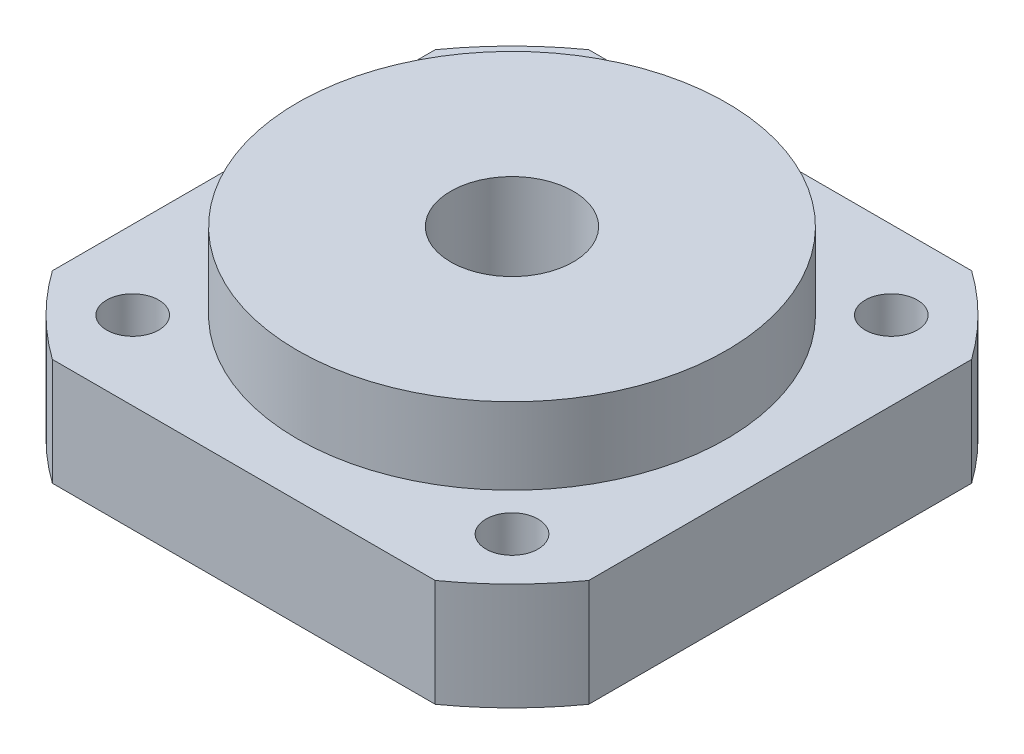
ISO-10303-21;
HEADER;
FILE_DESCRIPTION(('STEP AP214'),'2;1');
FILE_NAME('part.step','',(''),(''),'','','');
FILE_SCHEMA(('AUTOMOTIVE_DESIGN { 1 0 10303 214 1 1 1 1 }'));
ENDSEC;
DATA;
#1=APPLICATION_CONTEXT('core data for automotive mechanical design processes');
#2=APPLICATION_PROTOCOL_DEFINITION('international standard','automotive_design',2000,#1);
#3=PRODUCT_CONTEXT('',#1,'mechanical');
#4=PRODUCT('Part','Part','',(#3));
#5=PRODUCT_RELATED_PRODUCT_CATEGORY('part','',(#4));
#6=PRODUCT_DEFINITION_FORMATION('','',#4);
#7=PRODUCT_DEFINITION_CONTEXT('part definition',#1,'design');
#8=PRODUCT_DEFINITION('design','',#6,#7);
#9=PRODUCT_DEFINITION_SHAPE('','',#8);
#10=(LENGTH_UNIT() NAMED_UNIT(*) SI_UNIT(.MILLI.,.METRE.));
#11=(NAMED_UNIT(*) PLANE_ANGLE_UNIT() SI_UNIT($,.RADIAN.));
#12=(NAMED_UNIT(*) SI_UNIT($,.STERADIAN.) SOLID_ANGLE_UNIT());
#13=UNCERTAINTY_MEASURE_WITH_UNIT(LENGTH_MEASURE(1.E-05),#10,'distance_accuracy_value','');
#14=(GEOMETRIC_REPRESENTATION_CONTEXT(3) GLOBAL_UNCERTAINTY_ASSIGNED_CONTEXT((#13)) GLOBAL_UNIT_ASSIGNED_CONTEXT((#10,
#11,#12)) REPRESENTATION_CONTEXT('',''));
#15=CARTESIAN_POINT('',(0.,0.,0.));
#16=DIRECTION('',(0.,0.,1.));
#17=DIRECTION('',(1.,0.,0.));
#18=AXIS2_PLACEMENT_3D('',#15,#16,#17);
#19=CARTESIAN_POINT('',(-12.3743686707646,12.,-12.3743686707646));
#20=DIRECTION('',(0.,-1.,0.));
#21=DIRECTION('',(0.,0.,-1.));
#22=AXIS2_PLACEMENT_3D('',#19,#20,#21);
#23=CYLINDRICAL_SURFACE('',#22,1.7);
#24=CARTESIAN_POINT('',(-12.3743686707646,7.,-12.3743686707646));
#25=DIRECTION('',(0.,1.,0.));
#26=DIRECTION('',(0.,0.,1.));
#27=AXIS2_PLACEMENT_3D('',#24,#25,#26);
#28=CIRCLE('',#27,1.7);
#29=CARTESIAN_POINT('',(-12.3743686707646,7.,-10.6743686707646));
#30=VERTEX_POINT('',#29);
#31=EDGE_CURVE('E209',#30,#30,#28,.T.);
#32=ORIENTED_EDGE('',*,*,#31,.T.);
#33=EDGE_LOOP('',(#32));
#34=FACE_BOUND('',#33,.T.);
#35=CARTESIAN_POINT('',(-12.3743686707646,4.,-12.3743686707646));
#36=DIRECTION('',(0.,-1.,0.));
#37=DIRECTION('',(0.,0.,-1.));
#38=AXIS2_PLACEMENT_3D('',#35,#36,#37);
#39=CIRCLE('',#38,1.7);
#40=CARTESIAN_POINT('',(-12.3743686707646,4.,-14.0743686707646));
#41=VERTEX_POINT('',#40);
#42=EDGE_CURVE('E38',#41,#41,#39,.T.);
#43=ORIENTED_EDGE('',*,*,#42,.T.);
#44=EDGE_LOOP('',(#43));
#45=FACE_BOUND('',#44,.T.);
#46=ADVANCED_FACE('F34',(#34,#45),#23,.F.);
#47=CARTESIAN_POINT('',(12.3743686707646,12.,-12.3743686707646));
#48=DIRECTION('',(0.,-1.,0.));
#49=DIRECTION('',(0.,0.,-1.));
#50=AXIS2_PLACEMENT_3D('',#47,#48,#49);
#51=CYLINDRICAL_SURFACE('',#50,1.7);
#52=CARTESIAN_POINT('',(12.3743686707646,7.,-12.3743686707646));
#53=DIRECTION('',(0.,1.,0.));
#54=DIRECTION('',(0.,0.,1.));
#55=AXIS2_PLACEMENT_3D('',#52,#53,#54);
#56=CIRCLE('',#55,1.7);
#57=CARTESIAN_POINT('',(12.3743686707646,7.,-10.6743686707646));
#58=VERTEX_POINT('',#57);
#59=EDGE_CURVE('E206',#58,#58,#56,.T.);
#60=ORIENTED_EDGE('',*,*,#59,.T.);
#61=EDGE_LOOP('',(#60));
#62=FACE_BOUND('',#61,.T.);
#63=CARTESIAN_POINT('',(12.3743686707646,4.,-12.3743686707646));
#64=DIRECTION('',(0.,-1.,0.));
#65=DIRECTION('',(0.,0.,-1.));
#66=AXIS2_PLACEMENT_3D('',#63,#64,#65);
#67=CIRCLE('',#66,1.7);
#68=CARTESIAN_POINT('',(12.3743686707646,4.,-14.0743686707646));
#69=VERTEX_POINT('',#68);
#70=EDGE_CURVE('E171',#69,#69,#67,.T.);
#71=ORIENTED_EDGE('',*,*,#70,.T.);
#72=EDGE_LOOP('',(#71));
#73=FACE_BOUND('',#72,.T.);
#74=ADVANCED_FACE('F253',(#62,#73),#51,.F.);
#75=CARTESIAN_POINT('',(12.3743686707646,12.,12.3743686707646));
#76=DIRECTION('',(0.,-1.,0.));
#77=DIRECTION('',(0.,0.,-1.));
#78=AXIS2_PLACEMENT_3D('',#75,#76,#77);
#79=CYLINDRICAL_SURFACE('',#78,1.7);
#80=CARTESIAN_POINT('',(12.3743686707646,7.,12.3743686707646));
#81=DIRECTION('',(0.,1.,0.));
#82=DIRECTION('',(0.,0.,1.));
#83=AXIS2_PLACEMENT_3D('',#80,#81,#82);
#84=CIRCLE('',#83,1.7);
#85=CARTESIAN_POINT('',(12.3743686707646,7.,14.0743686707646));
#86=VERTEX_POINT('',#85);
#87=EDGE_CURVE('E161',#86,#86,#84,.T.);
#88=ORIENTED_EDGE('',*,*,#87,.T.);
#89=EDGE_LOOP('',(#88));
#90=FACE_BOUND('',#89,.T.);
#91=CARTESIAN_POINT('',(12.3743686707646,4.,12.3743686707646));
#92=DIRECTION('',(0.,-1.,0.));
#93=DIRECTION('',(0.,0.,-1.));
#94=AXIS2_PLACEMENT_3D('',#91,#92,#93);
#95=CIRCLE('',#94,1.7);
#96=CARTESIAN_POINT('',(12.3743686707646,4.,10.6743686707646));
#97=VERTEX_POINT('',#96);
#98=EDGE_CURVE('E167',#97,#97,#95,.T.);
#99=ORIENTED_EDGE('',*,*,#98,.T.);
#100=EDGE_LOOP('',(#99));
#101=FACE_BOUND('',#100,.T.);
#102=ADVANCED_FACE('F259',(#90,#101),#79,.F.);
#103=CARTESIAN_POINT('',(-12.3743686707646,12.,12.3743686707646));
#104=DIRECTION('',(0.,-1.,0.));
#105=DIRECTION('',(0.,0.,-1.));
#106=AXIS2_PLACEMENT_3D('',#103,#104,#105);
#107=CYLINDRICAL_SURFACE('',#106,1.7);
#108=CARTESIAN_POINT('',(-12.3743686707646,7.,12.3743686707646));
#109=DIRECTION('',(0.,1.,0.));
#110=DIRECTION('',(0.,0.,1.));
#111=AXIS2_PLACEMENT_3D('',#108,#109,#110);
#112=CIRCLE('',#111,1.7);
#113=CARTESIAN_POINT('',(-12.3743686707646,7.,14.0743686707646));
#114=VERTEX_POINT('',#113);
#115=EDGE_CURVE('E158',#114,#114,#112,.T.);
#116=ORIENTED_EDGE('',*,*,#115,.T.);
#117=EDGE_LOOP('',(#116));
#118=FACE_BOUND('',#117,.T.);
#119=CARTESIAN_POINT('',(-12.3743686707646,4.,12.3743686707646));
#120=DIRECTION('',(0.,-1.,0.));
#121=DIRECTION('',(0.,0.,-1.));
#122=AXIS2_PLACEMENT_3D('',#119,#120,#121);
#123=CIRCLE('',#122,1.7);
#124=CARTESIAN_POINT('',(-12.3743686707646,4.,10.6743686707646));
#125=VERTEX_POINT('',#124);
#126=EDGE_CURVE('E162',#125,#125,#123,.T.);
#127=ORIENTED_EDGE('',*,*,#126,.T.);
#128=EDGE_LOOP('',(#127));
#129=FACE_BOUND('',#128,.T.);
#130=ADVANCED_FACE('F270',(#118,#129),#107,.F.);
#131=CARTESIAN_POINT('',(0.,12.,0.));
#132=DIRECTION('',(0.,1.,0.));
#133=DIRECTION('',(0.,0.,1.));
#134=AXIS2_PLACEMENT_3D('',#131,#132,#133);
#135=PLANE('',#134);
#136=CARTESIAN_POINT('',(0.,12.,0.));
#137=DIRECTION('',(0.,1.,0.));
#138=DIRECTION('',(0.,0.,1.));
#139=AXIS2_PLACEMENT_3D('',#136,#137,#138);
#140=CIRCLE('',#139,4.);
#141=CARTESIAN_POINT('',(0.,12.,4.));
#142=VERTEX_POINT('',#141);
#143=EDGE_CURVE('E122',#142,#142,#140,.T.);
#144=ORIENTED_EDGE('',*,*,#143,.F.);
#145=EDGE_LOOP('',(#144));
#146=FACE_BOUND('',#145,.T.);
#147=CARTESIAN_POINT('',(0.,12.,0.));
#148=DIRECTION('',(0.,1.,0.));
#149=DIRECTION('',(0.,0.,1.));
#150=AXIS2_PLACEMENT_3D('',#147,#148,#149);
#151=CIRCLE('',#150,14.);
#152=CARTESIAN_POINT('',(0.,12.,14.));
#153=VERTEX_POINT('',#152);
#154=EDGE_CURVE('E165',#153,#153,#151,.T.);
#155=ORIENTED_EDGE('',*,*,#154,.T.);
#156=EDGE_LOOP('',(#155));
#157=FACE_BOUND('',#156,.T.);
#158=ADVANCED_FACE('F268',(#146,#157),#135,.T.);
#159=CARTESIAN_POINT('',(0.,12.,0.));
#160=DIRECTION('',(0.,-1.,0.));
#161=DIRECTION('',(0.,0.,-1.));
#162=AXIS2_PLACEMENT_3D('',#159,#160,#161);
#163=CYLINDRICAL_SURFACE('',#162,21.5);
#164=CARTESIAN_POINT('',(0.,7.,0.));
#165=DIRECTION('',(0.,1.,0.));
#166=DIRECTION('',(0.,0.,1.));
#167=AXIS2_PLACEMENT_3D('',#164,#165,#166);
#168=CIRCLE('',#167,21.5);
#169=CARTESIAN_POINT('',(12.4899959967968,7.,17.5));
#170=VERTEX_POINT('',#169);
#171=CARTESIAN_POINT('',(17.5,7.,12.4899959967968));
#172=VERTEX_POINT('',#171);
#173=EDGE_CURVE('E99',#170,#172,#168,.T.);
#174=ORIENTED_EDGE('',*,*,#173,.F.);
#175=DIRECTION('',(0.,-1.,0.));
#176=VECTOR('',#175,1.);
#177=CARTESIAN_POINT('',(12.4899959967968,12.,17.5));
#178=LINE('',#177,#176);
#179=CARTESIAN_POINT('',(12.4899959967968,0.,17.5));
#180=VERTEX_POINT('',#179);
#181=EDGE_CURVE('E59',#170,#180,#178,.T.);
#182=ORIENTED_EDGE('',*,*,#181,.T.);
#183=CARTESIAN_POINT('',(0.,0.,0.));
#184=DIRECTION('',(0.,1.,0.));
#185=DIRECTION('',(0.,0.,1.));
#186=AXIS2_PLACEMENT_3D('',#183,#184,#185);
#187=CIRCLE('',#186,21.5);
#188=CARTESIAN_POINT('',(17.5,0.,12.4899959967968));
#189=VERTEX_POINT('',#188);
#190=EDGE_CURVE('E118',#180,#189,#187,.T.);
#191=ORIENTED_EDGE('',*,*,#190,.T.);
#192=DIRECTION('',(0.,-1.,0.));
#193=VECTOR('',#192,1.);
#194=CARTESIAN_POINT('',(17.5,12.,12.4899959967968));
#195=LINE('',#194,#193);
#196=EDGE_CURVE('E11',#172,#189,#195,.T.);
#197=ORIENTED_EDGE('',*,*,#196,.F.);
#198=EDGE_LOOP('',(#174,#182,#191,#197));
#199=FACE_BOUND('',#198,.T.);
#200=ADVANCED_FACE('F36',(#199),#163,.T.);
#201=CARTESIAN_POINT('',(17.5,12.,12.4899959967968));
#202=DIRECTION('',(-1.,0.,0.));
#203=DIRECTION('',(0.,0.,1.));
#204=AXIS2_PLACEMENT_3D('',#201,#202,#203);
#205=PLANE('',#204);
#206=DIRECTION('',(0.,0.,-1.));
#207=VECTOR('',#206,1.);
#208=CARTESIAN_POINT('',(17.5,7.,-17.5));
#209=LINE('',#208,#207);
#210=CARTESIAN_POINT('',(17.5,7.,-12.4899959967968));
#211=VERTEX_POINT('',#210);
#212=EDGE_CURVE('E102',#172,#211,#209,.T.);
#213=ORIENTED_EDGE('',*,*,#212,.F.);
#214=ORIENTED_EDGE('',*,*,#196,.T.);
#215=DIRECTION('',(0.,0.,-1.));
#216=VECTOR('',#215,1.);
#217=CARTESIAN_POINT('',(17.5,0.,12.4899959967968));
#218=LINE('',#217,#216);
#219=CARTESIAN_POINT('',(17.5,0.,-12.4899959967968));
#220=VERTEX_POINT('',#219);
#221=EDGE_CURVE('E121',#189,#220,#218,.T.);
#222=ORIENTED_EDGE('',*,*,#221,.T.);
#223=DIRECTION('',(0.,-1.,0.));
#224=VECTOR('',#223,1.);
#225=CARTESIAN_POINT('',(17.5,12.,-12.4899959967968));
#226=LINE('',#225,#224);
#227=EDGE_CURVE('E43',#211,#220,#226,.T.);
#228=ORIENTED_EDGE('',*,*,#227,.F.);
#229=EDGE_LOOP('',(#213,#214,#222,#228));
#230=FACE_BOUND('',#229,.T.);
#231=ADVANCED_FACE('F111',(#230),#205,.F.);
#232=CARTESIAN_POINT('',(0.,12.,0.));
#233=DIRECTION('',(0.,-1.,0.));
#234=DIRECTION('',(0.,0.,-1.));
#235=AXIS2_PLACEMENT_3D('',#232,#233,#234);
#236=CYLINDRICAL_SURFACE('',#235,21.5);
#237=CARTESIAN_POINT('',(0.,7.,0.));
#238=DIRECTION('',(0.,1.,0.));
#239=DIRECTION('',(0.,0.,1.));
#240=AXIS2_PLACEMENT_3D('',#237,#238,#239);
#241=CIRCLE('',#240,21.5);
#242=CARTESIAN_POINT('',(12.4899959967968,7.,-17.5));
#243=VERTEX_POINT('',#242);
#244=EDGE_CURVE('E107',#211,#243,#241,.T.);
#245=ORIENTED_EDGE('',*,*,#244,.F.);
#246=ORIENTED_EDGE('',*,*,#227,.T.);
#247=CARTESIAN_POINT('',(0.,0.,0.));
#248=DIRECTION('',(0.,1.,0.));
#249=DIRECTION('',(0.,0.,1.));
#250=AXIS2_PLACEMENT_3D('',#247,#248,#249);
#251=CIRCLE('',#250,21.5);
#252=CARTESIAN_POINT('',(12.4899959967968,0.,-17.5));
#253=VERTEX_POINT('',#252);
#254=EDGE_CURVE('E124',#220,#253,#251,.T.);
#255=ORIENTED_EDGE('',*,*,#254,.T.);
#256=DIRECTION('',(0.,-1.,0.));
#257=VECTOR('',#256,1.);
#258=CARTESIAN_POINT('',(12.4899959967968,12.,-17.5));
#259=LINE('',#258,#257);
#260=EDGE_CURVE('E155',#243,#253,#259,.T.);
#261=ORIENTED_EDGE('',*,*,#260,.F.);
#262=EDGE_LOOP('',(#245,#246,#255,#261));
#263=FACE_BOUND('',#262,.T.);
#264=ADVANCED_FACE('F222',(#263),#236,.T.);
#265=CARTESIAN_POINT('',(-12.4899959967968,12.,-17.5));
#266=DIRECTION('',(0.,0.,1.));
#267=DIRECTION('',(1.,0.,0.));
#268=AXIS2_PLACEMENT_3D('',#265,#266,#267);
#269=PLANE('',#268);
#270=DIRECTION('',(-1.,0.,0.));
#271=VECTOR('',#270,1.);
#272=CARTESIAN_POINT('',(-17.5,7.,-17.5));
#273=LINE('',#272,#271);
#274=CARTESIAN_POINT('',(-12.4899959967968,7.,-17.5));
#275=VERTEX_POINT('',#274);
#276=EDGE_CURVE('E114',#243,#275,#273,.T.);
#277=ORIENTED_EDGE('',*,*,#276,.F.);
#278=ORIENTED_EDGE('',*,*,#260,.T.);
#279=DIRECTION('',(-1.,0.,0.));
#280=VECTOR('',#279,1.);
#281=CARTESIAN_POINT('',(-12.4899959967968,0.,-17.5));
#282=LINE('',#281,#280);
#283=CARTESIAN_POINT('',(-12.4899959967968,0.,-17.5));
#284=VERTEX_POINT('',#283);
#285=EDGE_CURVE('E132',#253,#284,#282,.T.);
#286=ORIENTED_EDGE('',*,*,#285,.T.);
#287=DIRECTION('',(0.,-1.,0.));
#288=VECTOR('',#287,1.);
#289=CARTESIAN_POINT('',(-12.4899959967968,12.,-17.5));
#290=LINE('',#289,#288);
#291=EDGE_CURVE('E153',#275,#284,#290,.T.);
#292=ORIENTED_EDGE('',*,*,#291,.F.);
#293=EDGE_LOOP('',(#277,#278,#286,#292));
#294=FACE_BOUND('',#293,.T.);
#295=ADVANCED_FACE('F221',(#294),#269,.F.);
#296=CARTESIAN_POINT('',(0.,12.,0.));
#297=DIRECTION('',(0.,-1.,0.));
#298=DIRECTION('',(0.,0.,-1.));
#299=AXIS2_PLACEMENT_3D('',#296,#297,#298);
#300=CYLINDRICAL_SURFACE('',#299,21.5);
#301=CARTESIAN_POINT('',(0.,7.,0.));
#302=DIRECTION('',(0.,1.,0.));
#303=DIRECTION('',(0.,0.,1.));
#304=AXIS2_PLACEMENT_3D('',#301,#302,#303);
#305=CIRCLE('',#304,21.5);
#306=CARTESIAN_POINT('',(-17.5,7.,-12.4899959967968));
#307=VERTEX_POINT('',#306);
#308=EDGE_CURVE('E213',#275,#307,#305,.T.);
#309=ORIENTED_EDGE('',*,*,#308,.F.);
#310=ORIENTED_EDGE('',*,*,#291,.T.);
#311=CARTESIAN_POINT('',(0.,0.,0.));
#312=DIRECTION('',(0.,1.,0.));
#313=DIRECTION('',(0.,0.,1.));
#314=AXIS2_PLACEMENT_3D('',#311,#312,#313);
#315=CIRCLE('',#314,21.5);
#316=CARTESIAN_POINT('',(-17.5,0.,-12.4899959967968));
#317=VERTEX_POINT('',#316);
#318=EDGE_CURVE('E135',#284,#317,#315,.T.);
#319=ORIENTED_EDGE('',*,*,#318,.T.);
#320=DIRECTION('',(0.,-1.,0.));
#321=VECTOR('',#320,1.);
#322=CARTESIAN_POINT('',(-17.5,12.,-12.4899959967968));
#323=LINE('',#322,#321);
#324=EDGE_CURVE('E151',#307,#317,#323,.T.);
#325=ORIENTED_EDGE('',*,*,#324,.F.);
#326=EDGE_LOOP('',(#309,#310,#319,#325));
#327=FACE_BOUND('',#326,.T.);
#328=ADVANCED_FACE('F232',(#327),#300,.T.);
#329=CARTESIAN_POINT('',(-17.5,12.,12.4899959967968));
#330=DIRECTION('',(1.,0.,0.));
#331=DIRECTION('',(0.,0.,-1.));
#332=AXIS2_PLACEMENT_3D('',#329,#330,#331);
#333=PLANE('',#332);
#334=DIRECTION('',(0.,0.,1.));
#335=VECTOR('',#334,1.);
#336=CARTESIAN_POINT('',(-17.5,7.,-17.5));
#337=LINE('',#336,#335);
#338=CARTESIAN_POINT('',(-17.5,7.,12.4899959967968));
#339=VERTEX_POINT('',#338);
#340=EDGE_CURVE('E201',#307,#339,#337,.T.);
#341=ORIENTED_EDGE('',*,*,#340,.F.);
#342=ORIENTED_EDGE('',*,*,#324,.T.);
#343=DIRECTION('',(0.,0.,1.));
#344=VECTOR('',#343,1.);
#345=CARTESIAN_POINT('',(-17.5,0.,12.4899959967968));
#346=LINE('',#345,#344);
#347=CARTESIAN_POINT('',(-17.5,0.,12.4899959967968));
#348=VERTEX_POINT('',#347);
#349=EDGE_CURVE('E138',#317,#348,#346,.T.);
#350=ORIENTED_EDGE('',*,*,#349,.T.);
#351=DIRECTION('',(0.,-1.,0.));
#352=VECTOR('',#351,1.);
#353=CARTESIAN_POINT('',(-17.5,12.,12.4899959967968));
#354=LINE('',#353,#352);
#355=EDGE_CURVE('E149',#339,#348,#354,.T.);
#356=ORIENTED_EDGE('',*,*,#355,.F.);
#357=EDGE_LOOP('',(#341,#342,#350,#356));
#358=FACE_BOUND('',#357,.T.);
#359=ADVANCED_FACE('F236',(#358),#333,.F.);
#360=CARTESIAN_POINT('',(0.,12.,0.));
#361=DIRECTION('',(0.,-1.,0.));
#362=DIRECTION('',(0.,0.,-1.));
#363=AXIS2_PLACEMENT_3D('',#360,#361,#362);
#364=CYLINDRICAL_SURFACE('',#363,21.5);
#365=CARTESIAN_POINT('',(0.,7.,0.));
#366=DIRECTION('',(0.,1.,0.));
#367=DIRECTION('',(0.,0.,1.));
#368=AXIS2_PLACEMENT_3D('',#365,#366,#367);
#369=CIRCLE('',#368,21.5);
#370=CARTESIAN_POINT('',(-12.4899959967968,7.,17.5));
#371=VERTEX_POINT('',#370);
#372=EDGE_CURVE('E51',#339,#371,#369,.T.);
#373=ORIENTED_EDGE('',*,*,#372,.F.);
#374=ORIENTED_EDGE('',*,*,#355,.T.);
#375=CARTESIAN_POINT('',(0.,0.,0.));
#376=DIRECTION('',(0.,1.,0.));
#377=DIRECTION('',(0.,0.,1.));
#378=AXIS2_PLACEMENT_3D('',#375,#376,#377);
#379=CIRCLE('',#378,21.5);
#380=CARTESIAN_POINT('',(-12.4899959967968,0.,17.5));
#381=VERTEX_POINT('',#380);
#382=EDGE_CURVE('E141',#348,#381,#379,.T.);
#383=ORIENTED_EDGE('',*,*,#382,.T.);
#384=DIRECTION('',(0.,-1.,0.));
#385=VECTOR('',#384,1.);
#386=CARTESIAN_POINT('',(-12.4899959967968,12.,17.5));
#387=LINE('',#386,#385);
#388=EDGE_CURVE('E147',#371,#381,#387,.T.);
#389=ORIENTED_EDGE('',*,*,#388,.F.);
#390=EDGE_LOOP('',(#373,#374,#383,#389));
#391=FACE_BOUND('',#390,.T.);
#392=ADVANCED_FACE('F238',(#391),#364,.T.);
#393=CARTESIAN_POINT('',(-12.4899959967968,12.,17.5));
#394=DIRECTION('',(0.,0.,-1.));
#395=DIRECTION('',(-1.,0.,0.));
#396=AXIS2_PLACEMENT_3D('',#393,#394,#395);
#397=PLANE('',#396);
#398=DIRECTION('',(1.,0.,0.));
#399=VECTOR('',#398,1.);
#400=CARTESIAN_POINT('',(-17.5,7.,17.5));
#401=LINE('',#400,#399);
#402=EDGE_CURVE('E104',#371,#170,#401,.T.);
#403=ORIENTED_EDGE('',*,*,#402,.F.);
#404=ORIENTED_EDGE('',*,*,#388,.T.);
#405=DIRECTION('',(1.,0.,0.));
#406=VECTOR('',#405,1.);
#407=CARTESIAN_POINT('',(-12.4899959967968,0.,17.5));
#408=LINE('',#407,#406);
#409=EDGE_CURVE('E144',#381,#180,#408,.T.);
#410=ORIENTED_EDGE('',*,*,#409,.T.);
#411=ORIENTED_EDGE('',*,*,#181,.F.);
#412=EDGE_LOOP('',(#403,#404,#410,#411));
#413=FACE_BOUND('',#412,.T.);
#414=ADVANCED_FACE('F241',(#413),#397,.F.);
#415=CARTESIAN_POINT('',(0.,0.,0.));
#416=DIRECTION('',(0.,1.,0.));
#417=DIRECTION('',(0.,0.,1.));
#418=AXIS2_PLACEMENT_3D('',#415,#416,#417);
#419=PLANE('',#418);
#420=CARTESIAN_POINT('',(-12.3743686707646,0.,-12.3743686707646));
#421=DIRECTION('',(0.,-1.,0.));
#422=DIRECTION('',(0.,0.,-1.));
#423=AXIS2_PLACEMENT_3D('',#420,#421,#422);
#424=CIRCLE('',#423,3.25);
#425=CARTESIAN_POINT('',(-12.3743686707646,0.,-15.6243686707646));
#426=VERTEX_POINT('',#425);
#427=EDGE_CURVE('E187',#426,#426,#424,.T.);
#428=ORIENTED_EDGE('',*,*,#427,.F.);
#429=EDGE_LOOP('',(#428));
#430=FACE_BOUND('',#429,.T.);
#431=CARTESIAN_POINT('',(12.3743686707646,0.,-12.3743686707646));
#432=DIRECTION('',(0.,-1.,0.));
#433=DIRECTION('',(0.,0.,-1.));
#434=AXIS2_PLACEMENT_3D('',#431,#432,#433);
#435=CIRCLE('',#434,3.25);
#436=CARTESIAN_POINT('',(12.3743686707646,0.,-15.6243686707646));
#437=VERTEX_POINT('',#436);
#438=EDGE_CURVE('E180',#437,#437,#435,.T.);
#439=ORIENTED_EDGE('',*,*,#438,.F.);
#440=EDGE_LOOP('',(#439));
#441=FACE_BOUND('',#440,.T.);
#442=CARTESIAN_POINT('',(12.3743686707646,0.,12.3743686707646));
#443=DIRECTION('',(0.,-1.,0.));
#444=DIRECTION('',(0.,0.,-1.));
#445=AXIS2_PLACEMENT_3D('',#442,#443,#444);
#446=CIRCLE('',#445,3.25);
#447=CARTESIAN_POINT('',(12.3743686707646,0.,9.12436867076459));
#448=VERTEX_POINT('',#447);
#449=EDGE_CURVE('E173',#448,#448,#446,.T.);
#450=ORIENTED_EDGE('',*,*,#449,.F.);
#451=EDGE_LOOP('',(#450));
#452=FACE_BOUND('',#451,.T.);
#453=CARTESIAN_POINT('',(-12.3743686707646,0.,12.3743686707646));
#454=DIRECTION('',(0.,-1.,0.));
#455=DIRECTION('',(0.,0.,-1.));
#456=AXIS2_PLACEMENT_3D('',#453,#454,#455);
#457=CIRCLE('',#456,3.25);
#458=CARTESIAN_POINT('',(-12.3743686707646,0.,9.12436867076459));
#459=VERTEX_POINT('',#458);
#460=EDGE_CURVE('E169',#459,#459,#457,.T.);
#461=ORIENTED_EDGE('',*,*,#460,.F.);
#462=EDGE_LOOP('',(#461));
#463=FACE_BOUND('',#462,.T.);
#464=ORIENTED_EDGE('',*,*,#190,.F.);
#465=ORIENTED_EDGE('',*,*,#409,.F.);
#466=ORIENTED_EDGE('',*,*,#382,.F.);
#467=ORIENTED_EDGE('',*,*,#349,.F.);
#468=ORIENTED_EDGE('',*,*,#318,.F.);
#469=ORIENTED_EDGE('',*,*,#285,.F.);
#470=ORIENTED_EDGE('',*,*,#254,.F.);
#471=ORIENTED_EDGE('',*,*,#221,.F.);
#472=EDGE_LOOP('',(#464,#465,#466,#467,#468,#469,#470,#471));
#473=FACE_BOUND('',#472,.T.);
#474=CARTESIAN_POINT('',(0.,0.,0.));
#475=DIRECTION('',(0.,1.,0.));
#476=DIRECTION('',(0.,0.,1.));
#477=AXIS2_PLACEMENT_3D('',#474,#475,#476);
#478=CIRCLE('',#477,4.);
#479=CARTESIAN_POINT('',(0.,0.,4.));
#480=VERTEX_POINT('',#479);
#481=EDGE_CURVE('E106',#480,#480,#478,.T.);
#482=ORIENTED_EDGE('',*,*,#481,.T.);
#483=EDGE_LOOP('',(#482));
#484=FACE_BOUND('',#483,.T.);
#485=ADVANCED_FACE('F226',(#430,#441,#452,#463,#473,#484),#419,.F.);
#486=CARTESIAN_POINT('',(0.,12.,0.));
#487=DIRECTION('',(0.,-1.,0.));
#488=DIRECTION('',(0.,0.,-1.));
#489=AXIS2_PLACEMENT_3D('',#486,#487,#488);
#490=CYLINDRICAL_SURFACE('',#489,4.);
#491=ORIENTED_EDGE('',*,*,#143,.T.);
#492=EDGE_LOOP('',(#491));
#493=FACE_BOUND('',#492,.T.);
#494=ORIENTED_EDGE('',*,*,#481,.F.);
#495=EDGE_LOOP('',(#494));
#496=FACE_BOUND('',#495,.T.);
#497=ADVANCED_FACE('F248',(#493,#496),#490,.F.);
#498=CARTESIAN_POINT('',(0.,7.,0.));
#499=DIRECTION('',(0.,1.,0.));
#500=DIRECTION('',(0.,0.,1.));
#501=AXIS2_PLACEMENT_3D('',#498,#499,#500);
#502=PLANE('',#501);
#503=ORIENTED_EDGE('',*,*,#31,.F.);
#504=EDGE_LOOP('',(#503));
#505=FACE_BOUND('',#504,.T.);
#506=ORIENTED_EDGE('',*,*,#59,.F.);
#507=EDGE_LOOP('',(#506));
#508=FACE_BOUND('',#507,.T.);
#509=ORIENTED_EDGE('',*,*,#87,.F.);
#510=EDGE_LOOP('',(#509));
#511=FACE_BOUND('',#510,.T.);
#512=ORIENTED_EDGE('',*,*,#115,.F.);
#513=EDGE_LOOP('',(#512));
#514=FACE_BOUND('',#513,.T.);
#515=CARTESIAN_POINT('',(0.,7.,0.));
#516=DIRECTION('',(0.,1.,0.));
#517=DIRECTION('',(0.,0.,1.));
#518=AXIS2_PLACEMENT_3D('',#515,#516,#517);
#519=CIRCLE('',#518,14.);
#520=CARTESIAN_POINT('',(0.,7.,14.));
#521=VERTEX_POINT('',#520);
#522=EDGE_CURVE('E115',#521,#521,#519,.T.);
#523=ORIENTED_EDGE('',*,*,#522,.F.);
#524=EDGE_LOOP('',(#523));
#525=FACE_BOUND('',#524,.T.);
#526=ORIENTED_EDGE('',*,*,#173,.T.);
#527=ORIENTED_EDGE('',*,*,#212,.T.);
#528=ORIENTED_EDGE('',*,*,#244,.T.);
#529=ORIENTED_EDGE('',*,*,#276,.T.);
#530=ORIENTED_EDGE('',*,*,#308,.T.);
#531=ORIENTED_EDGE('',*,*,#340,.T.);
#532=ORIENTED_EDGE('',*,*,#372,.T.);
#533=ORIENTED_EDGE('',*,*,#402,.T.);
#534=EDGE_LOOP('',(#526,#527,#528,#529,#530,#531,#532,#533));
#535=FACE_BOUND('',#534,.T.);
#536=ADVANCED_FACE('F101',(#505,#508,#511,#514,#525,#535),#502,.T.);
#537=CARTESIAN_POINT('',(0.,7.,0.));
#538=DIRECTION('',(0.,1.,0.));
#539=DIRECTION('',(0.,0.,1.));
#540=AXIS2_PLACEMENT_3D('',#537,#538,#539);
#541=CYLINDRICAL_SURFACE('',#540,14.);
#542=ORIENTED_EDGE('',*,*,#522,.T.);
#543=EDGE_LOOP('',(#542));
#544=FACE_BOUND('',#543,.T.);
#545=ORIENTED_EDGE('',*,*,#154,.F.);
#546=EDGE_LOOP('',(#545));
#547=FACE_BOUND('',#546,.T.);
#548=ADVANCED_FACE('F282',(#544,#547),#541,.T.);
#549=CARTESIAN_POINT('',(-12.3743686707646,4.,12.3743686707646));
#550=DIRECTION('',(0.,-1.,0.));
#551=DIRECTION('',(0.,0.,-1.));
#552=AXIS2_PLACEMENT_3D('',#549,#550,#551);
#553=CYLINDRICAL_SURFACE('',#552,3.25);
#554=CARTESIAN_POINT('',(-12.3743686707646,4.,12.3743686707646));
#555=DIRECTION('',(0.,-1.,0.));
#556=DIRECTION('',(0.,0.,-1.));
#557=AXIS2_PLACEMENT_3D('',#554,#555,#556);
#558=CIRCLE('',#557,3.25);
#559=CARTESIAN_POINT('',(-12.3743686707646,4.,9.12436867076459));
#560=VERTEX_POINT('',#559);
#561=EDGE_CURVE('E166',#560,#560,#558,.T.);
#562=ORIENTED_EDGE('',*,*,#561,.F.);
#563=EDGE_LOOP('',(#562));
#564=FACE_BOUND('',#563,.T.);
#565=ORIENTED_EDGE('',*,*,#460,.T.);
#566=EDGE_LOOP('',(#565));
#567=FACE_BOUND('',#566,.T.);
#568=ADVANCED_FACE('F284',(#564,#567),#553,.F.);
#569=CARTESIAN_POINT('',(-12.3743686707646,4.,12.3743686707646));
#570=DIRECTION('',(0.,-1.,0.));
#571=DIRECTION('',(0.,0.,-1.));
#572=AXIS2_PLACEMENT_3D('',#569,#570,#571);
#573=PLANE('',#572);
#574=ORIENTED_EDGE('',*,*,#126,.F.);
#575=EDGE_LOOP('',(#574));
#576=FACE_BOUND('',#575,.T.);
#577=ORIENTED_EDGE('',*,*,#561,.T.);
#578=EDGE_LOOP('',(#577));
#579=FACE_BOUND('',#578,.T.);
#580=ADVANCED_FACE('F291',(#576,#579),#573,.T.);
#581=CARTESIAN_POINT('',(12.3743686707646,4.,12.3743686707646));
#582=DIRECTION('',(0.,-1.,0.));
#583=DIRECTION('',(0.,0.,-1.));
#584=AXIS2_PLACEMENT_3D('',#581,#582,#583);
#585=CYLINDRICAL_SURFACE('',#584,3.25);
#586=CARTESIAN_POINT('',(12.3743686707646,4.,12.3743686707646));
#587=DIRECTION('',(0.,-1.,0.));
#588=DIRECTION('',(0.,0.,-1.));
#589=AXIS2_PLACEMENT_3D('',#586,#587,#588);
#590=CIRCLE('',#589,3.25);
#591=CARTESIAN_POINT('',(12.3743686707646,4.,9.12436867076459));
#592=VERTEX_POINT('',#591);
#593=EDGE_CURVE('E170',#592,#592,#590,.T.);
#594=ORIENTED_EDGE('',*,*,#593,.F.);
#595=EDGE_LOOP('',(#594));
#596=FACE_BOUND('',#595,.T.);
#597=ORIENTED_EDGE('',*,*,#449,.T.);
#598=EDGE_LOOP('',(#597));
#599=FACE_BOUND('',#598,.T.);
#600=ADVANCED_FACE('F309',(#596,#599),#585,.F.);
#601=CARTESIAN_POINT('',(12.3743686707646,4.,12.3743686707646));
#602=DIRECTION('',(0.,-1.,0.));
#603=DIRECTION('',(0.,0.,-1.));
#604=AXIS2_PLACEMENT_3D('',#601,#602,#603);
#605=PLANE('',#604);
#606=ORIENTED_EDGE('',*,*,#98,.F.);
#607=EDGE_LOOP('',(#606));
#608=FACE_BOUND('',#607,.T.);
#609=ORIENTED_EDGE('',*,*,#593,.T.);
#610=EDGE_LOOP('',(#609));
#611=FACE_BOUND('',#610,.T.);
#612=ADVANCED_FACE('F305',(#608,#611),#605,.T.);
#613=CARTESIAN_POINT('',(12.3743686707646,4.,-12.3743686707646));
#614=DIRECTION('',(0.,-1.,0.));
#615=DIRECTION('',(0.,0.,-1.));
#616=AXIS2_PLACEMENT_3D('',#613,#614,#615);
#617=CYLINDRICAL_SURFACE('',#616,3.25);
#618=CARTESIAN_POINT('',(12.3743686707646,4.,-12.3743686707646));
#619=DIRECTION('',(0.,-1.,0.));
#620=DIRECTION('',(0.,0.,-1.));
#621=AXIS2_PLACEMENT_3D('',#618,#619,#620);
#622=CIRCLE('',#621,3.25);
#623=CARTESIAN_POINT('',(12.3743686707646,4.,-15.6243686707646));
#624=VERTEX_POINT('',#623);
#625=EDGE_CURVE('E174',#624,#624,#622,.T.);
#626=ORIENTED_EDGE('',*,*,#625,.F.);
#627=EDGE_LOOP('',(#626));
#628=FACE_BOUND('',#627,.T.);
#629=ORIENTED_EDGE('',*,*,#438,.T.);
#630=EDGE_LOOP('',(#629));
#631=FACE_BOUND('',#630,.T.);
#632=ADVANCED_FACE('F308',(#628,#631),#617,.F.);
#633=CARTESIAN_POINT('',(12.3743686707646,4.,-12.3743686707646));
#634=DIRECTION('',(0.,-1.,0.));
#635=DIRECTION('',(0.,0.,-1.));
#636=AXIS2_PLACEMENT_3D('',#633,#634,#635);
#637=PLANE('',#636);
#638=ORIENTED_EDGE('',*,*,#70,.F.);
#639=EDGE_LOOP('',(#638));
#640=FACE_BOUND('',#639,.T.);
#641=ORIENTED_EDGE('',*,*,#625,.T.);
#642=EDGE_LOOP('',(#641));
#643=FACE_BOUND('',#642,.T.);
#644=ADVANCED_FACE('F328',(#640,#643),#637,.T.);
#645=CARTESIAN_POINT('',(-12.3743686707646,4.,-12.3743686707646));
#646=DIRECTION('',(0.,-1.,0.));
#647=DIRECTION('',(0.,0.,-1.));
#648=AXIS2_PLACEMENT_3D('',#645,#646,#647);
#649=CYLINDRICAL_SURFACE('',#648,3.25);
#650=CARTESIAN_POINT('',(-12.3743686707646,4.,-12.3743686707646));
#651=DIRECTION('',(0.,-1.,0.));
#652=DIRECTION('',(0.,0.,-1.));
#653=AXIS2_PLACEMENT_3D('',#650,#651,#652);
#654=CIRCLE('',#653,3.25);
#655=CARTESIAN_POINT('',(-12.3743686707646,4.,-15.6243686707646));
#656=VERTEX_POINT('',#655);
#657=EDGE_CURVE('E347',#656,#656,#654,.T.);
#658=ORIENTED_EDGE('',*,*,#657,.F.);
#659=EDGE_LOOP('',(#658));
#660=FACE_BOUND('',#659,.T.);
#661=ORIENTED_EDGE('',*,*,#427,.T.);
#662=EDGE_LOOP('',(#661));
#663=FACE_BOUND('',#662,.T.);
#664=ADVANCED_FACE('F332',(#660,#663),#649,.F.);
#665=CARTESIAN_POINT('',(-12.3743686707646,4.,-12.3743686707646));
#666=DIRECTION('',(0.,-1.,0.));
#667=DIRECTION('',(0.,0.,-1.));
#668=AXIS2_PLACEMENT_3D('',#665,#666,#667);
#669=PLANE('',#668);
#670=ORIENTED_EDGE('',*,*,#42,.F.);
#671=EDGE_LOOP('',(#670));
#672=FACE_BOUND('',#671,.T.);
#673=ORIENTED_EDGE('',*,*,#657,.T.);
#674=EDGE_LOOP('',(#673));
#675=FACE_BOUND('',#674,.T.);
#676=ADVANCED_FACE('F336',(#672,#675),#669,.T.);
#677=CLOSED_SHELL('',(#46,#74,#102,#130,#158,#200,#231,#264,#295,#328,#359,#392,#414,#485,#497,
#536,#548,#568,#580,#600,#612,#632,#644,#664,#676));
#678=MANIFOLD_SOLID_BREP('B2',#677);
#679=ADVANCED_BREP_SHAPE_REPRESENTATION('',(#18,#678),#14);
#680=SHAPE_DEFINITION_REPRESENTATION(#9,#679);
ENDSEC;
END-ISO-10303-21;
